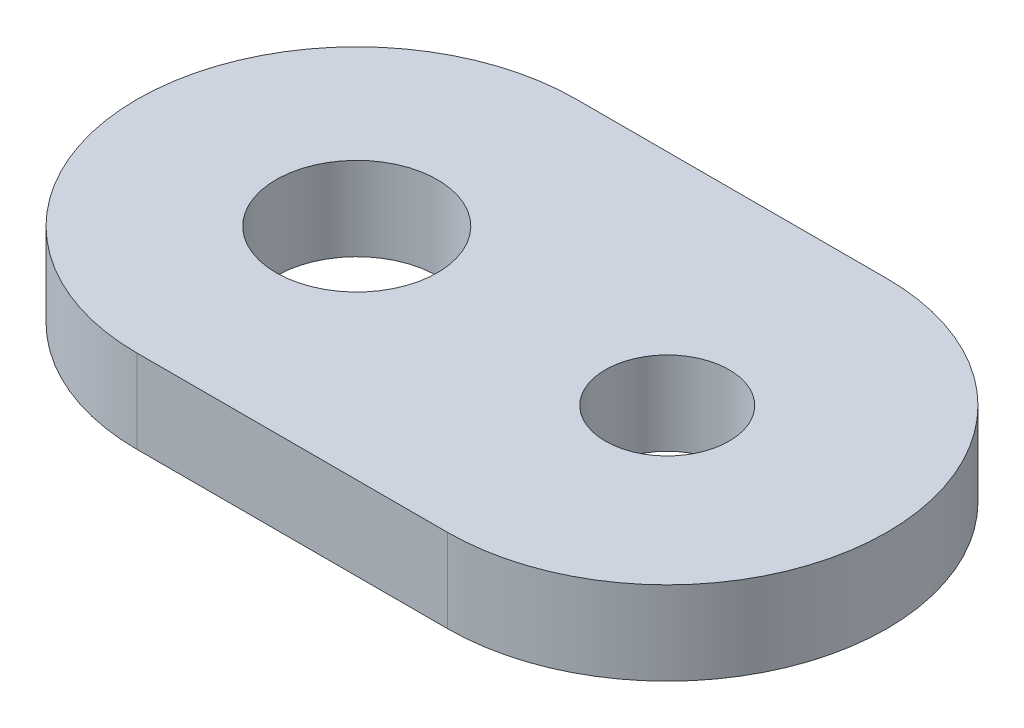
ISO-10303-21;
HEADER;
FILE_DESCRIPTION(('STEP AP214'),'2;1');
FILE_NAME('part.step','',(''),(''),'','','');
FILE_SCHEMA(('AUTOMOTIVE_DESIGN { 1 0 10303 214 1 1 1 1 }'));
ENDSEC;
DATA;
#1=APPLICATION_CONTEXT('core data for automotive mechanical design processes');
#2=APPLICATION_PROTOCOL_DEFINITION('international standard','automotive_design',2000,#1);
#3=PRODUCT_CONTEXT('',#1,'mechanical');
#4=PRODUCT('Part','Part','',(#3));
#5=PRODUCT_RELATED_PRODUCT_CATEGORY('part','',(#4));
#6=PRODUCT_DEFINITION_FORMATION('','',#4);
#7=PRODUCT_DEFINITION_CONTEXT('part definition',#1,'design');
#8=PRODUCT_DEFINITION('design','',#6,#7);
#9=PRODUCT_DEFINITION_SHAPE('','',#8);
#10=(LENGTH_UNIT() NAMED_UNIT(*) SI_UNIT(.MILLI.,.METRE.));
#11=(NAMED_UNIT(*) PLANE_ANGLE_UNIT() SI_UNIT($,.RADIAN.));
#12=(NAMED_UNIT(*) SI_UNIT($,.STERADIAN.) SOLID_ANGLE_UNIT());
#13=UNCERTAINTY_MEASURE_WITH_UNIT(LENGTH_MEASURE(1.E-05),#10,'distance_accuracy_value','');
#14=(GEOMETRIC_REPRESENTATION_CONTEXT(3) GLOBAL_UNCERTAINTY_ASSIGNED_CONTEXT((#13)) GLOBAL_UNIT_ASSIGNED_CONTEXT((#10,
#11,#12)) REPRESENTATION_CONTEXT('',''));
#15=CARTESIAN_POINT('',(0.,0.,0.));
#16=DIRECTION('',(0.,0.,1.));
#17=DIRECTION('',(1.,0.,0.));
#18=AXIS2_PLACEMENT_3D('',#15,#16,#17);
#19=CARTESIAN_POINT('',(5.581105,0.,0.));
#20=DIRECTION('',(0.,-1.,0.));
#21=DIRECTION('',(0.,0.,-1.));
#22=AXIS2_PLACEMENT_3D('',#19,#20,#21);
#23=CYLINDRICAL_SURFACE('',#22,7.9);
#24=CARTESIAN_POINT('',(5.581105,-3.,0.));
#25=DIRECTION('',(0.,-1.,0.));
#26=DIRECTION('',(0.,0.,-1.));
#27=AXIS2_PLACEMENT_3D('',#24,#25,#26);
#28=CIRCLE('',#27,7.9);
#29=CARTESIAN_POINT('',(5.581105,-3.,-7.9));
#30=VERTEX_POINT('',#29);
#31=CARTESIAN_POINT('',(5.581105,-3.,7.9));
#32=VERTEX_POINT('',#31);
#33=EDGE_CURVE('E101',#30,#32,#28,.T.);
#34=ORIENTED_EDGE('',*,*,#33,.F.);
#35=DIRECTION('',(0.,-1.,0.));
#36=VECTOR('',#35,1.);
#37=CARTESIAN_POINT('',(5.581105,0.,-7.9));
#38=LINE('',#37,#36);
#39=CARTESIAN_POINT('',(5.581105,0.,-7.9));
#40=VERTEX_POINT('',#39);
#41=EDGE_CURVE('E11',#40,#30,#38,.T.);
#42=ORIENTED_EDGE('',*,*,#41,.F.);
#43=CARTESIAN_POINT('',(5.581105,0.,0.));
#44=DIRECTION('',(0.,-1.,0.));
#45=DIRECTION('',(0.,0.,-1.));
#46=AXIS2_PLACEMENT_3D('',#43,#44,#45);
#47=CIRCLE('',#46,7.9);
#48=CARTESIAN_POINT('',(5.581105,0.,7.9));
#49=VERTEX_POINT('',#48);
#50=EDGE_CURVE('E94',#40,#49,#47,.T.);
#51=ORIENTED_EDGE('',*,*,#50,.T.);
#52=DIRECTION('',(0.,-1.,0.));
#53=VECTOR('',#52,1.);
#54=CARTESIAN_POINT('',(5.581105,0.,7.9));
#55=LINE('',#54,#53);
#56=EDGE_CURVE('E39',#49,#32,#55,.T.);
#57=ORIENTED_EDGE('',*,*,#56,.T.);
#58=EDGE_LOOP('',(#34,#42,#51,#57));
#59=FACE_BOUND('',#58,.T.);
#60=ADVANCED_FACE('F36',(#59),#23,.T.);
#61=CARTESIAN_POINT('',(-5.581105,0.,-7.9));
#62=DIRECTION('',(0.,0.,-1.));
#63=DIRECTION('',(-1.,0.,0.));
#64=AXIS2_PLACEMENT_3D('',#61,#62,#63);
#65=PLANE('',#64);
#66=DIRECTION('',(1.,0.,0.));
#67=VECTOR('',#66,1.);
#68=CARTESIAN_POINT('',(-5.581105,-3.,-7.9));
#69=LINE('',#68,#67);
#70=CARTESIAN_POINT('',(-5.581105,-3.,-7.9));
#71=VERTEX_POINT('',#70);
#72=EDGE_CURVE('E96',#71,#30,#69,.T.);
#73=ORIENTED_EDGE('',*,*,#72,.F.);
#74=DIRECTION('',(0.,-1.,0.));
#75=VECTOR('',#74,1.);
#76=CARTESIAN_POINT('',(-5.581105,0.,-7.9));
#77=LINE('',#76,#75);
#78=CARTESIAN_POINT('',(-5.581105,0.,-7.9));
#79=VERTEX_POINT('',#78);
#80=EDGE_CURVE('E45',#79,#71,#77,.T.);
#81=ORIENTED_EDGE('',*,*,#80,.F.);
#82=DIRECTION('',(1.,0.,0.));
#83=VECTOR('',#82,1.);
#84=CARTESIAN_POINT('',(-5.581105,0.,-7.9));
#85=LINE('',#84,#83);
#86=EDGE_CURVE('E91',#79,#40,#85,.T.);
#87=ORIENTED_EDGE('',*,*,#86,.T.);
#88=ORIENTED_EDGE('',*,*,#41,.T.);
#89=EDGE_LOOP('',(#73,#81,#87,#88));
#90=FACE_BOUND('',#89,.T.);
#91=ADVANCED_FACE('F112',(#90),#65,.T.);
#92=CARTESIAN_POINT('',(-5.581105,0.,0.));
#93=DIRECTION('',(0.,-1.,0.));
#94=DIRECTION('',(0.,0.,-1.));
#95=AXIS2_PLACEMENT_3D('',#92,#93,#94);
#96=CYLINDRICAL_SURFACE('',#95,7.9);
#97=CARTESIAN_POINT('',(-5.581105,-3.,0.));
#98=DIRECTION('',(0.,-1.,0.));
#99=DIRECTION('',(0.,0.,-1.));
#100=AXIS2_PLACEMENT_3D('',#97,#98,#99);
#101=CIRCLE('',#100,7.9);
#102=CARTESIAN_POINT('',(-5.581105,-3.,7.9));
#103=VERTEX_POINT('',#102);
#104=EDGE_CURVE('E86',#103,#71,#101,.T.);
#105=ORIENTED_EDGE('',*,*,#104,.F.);
#106=DIRECTION('',(0.,-1.,0.));
#107=VECTOR('',#106,1.);
#108=CARTESIAN_POINT('',(-5.581105,0.,7.9));
#109=LINE('',#108,#107);
#110=CARTESIAN_POINT('',(-5.581105,0.,7.9));
#111=VERTEX_POINT('',#110);
#112=EDGE_CURVE('E81',#111,#103,#109,.T.);
#113=ORIENTED_EDGE('',*,*,#112,.F.);
#114=CARTESIAN_POINT('',(-5.581105,0.,0.));
#115=DIRECTION('',(0.,-1.,0.));
#116=DIRECTION('',(0.,0.,-1.));
#117=AXIS2_PLACEMENT_3D('',#114,#115,#116);
#118=CIRCLE('',#117,7.9);
#119=EDGE_CURVE('E84',#111,#79,#118,.T.);
#120=ORIENTED_EDGE('',*,*,#119,.T.);
#121=ORIENTED_EDGE('',*,*,#80,.T.);
#122=EDGE_LOOP('',(#105,#113,#120,#121));
#123=FACE_BOUND('',#122,.T.);
#124=ADVANCED_FACE('F83',(#123),#96,.T.);
#125=CARTESIAN_POINT('',(5.581105,0.,7.9));
#126=DIRECTION('',(0.,0.,1.));
#127=DIRECTION('',(1.,0.,0.));
#128=AXIS2_PLACEMENT_3D('',#125,#126,#127);
#129=PLANE('',#128);
#130=DIRECTION('',(-1.,0.,0.));
#131=VECTOR('',#130,1.);
#132=CARTESIAN_POINT('',(5.581105,-3.,7.9));
#133=LINE('',#132,#131);
#134=EDGE_CURVE('E104',#32,#103,#133,.T.);
#135=ORIENTED_EDGE('',*,*,#134,.F.);
#136=ORIENTED_EDGE('',*,*,#56,.F.);
#137=DIRECTION('',(-1.,0.,0.));
#138=VECTOR('',#137,1.);
#139=CARTESIAN_POINT('',(5.581105,0.,7.9));
#140=LINE('',#139,#138);
#141=EDGE_CURVE('E90',#49,#111,#140,.T.);
#142=ORIENTED_EDGE('',*,*,#141,.T.);
#143=ORIENTED_EDGE('',*,*,#112,.T.);
#144=EDGE_LOOP('',(#135,#136,#142,#143));
#145=FACE_BOUND('',#144,.T.);
#146=ADVANCED_FACE('F93',(#145),#129,.T.);
#147=CARTESIAN_POINT('',(5.581105,0.,0.));
#148=DIRECTION('',(0.,-1.,0.));
#149=DIRECTION('',(0.,0.,-1.));
#150=AXIS2_PLACEMENT_3D('',#147,#148,#149);
#151=PLANE('',#150);
#152=CARTESIAN_POINT('',(5.581105,0.,0.));
#153=DIRECTION('',(0.,-1.,0.));
#154=DIRECTION('',(0.,0.,1.));
#155=AXIS2_PLACEMENT_3D('',#152,#153,#154);
#156=CIRCLE('',#155,2.225);
#157=CARTESIAN_POINT('',(5.581105,0.,2.225));
#158=VERTEX_POINT('',#157);
#159=EDGE_CURVE('E145',#158,#158,#156,.T.);
#160=ORIENTED_EDGE('',*,*,#159,.T.);
#161=EDGE_LOOP('',(#160));
#162=FACE_BOUND('',#161,.T.);
#163=CARTESIAN_POINT('',(-5.581105,0.,0.));
#164=DIRECTION('',(0.,-1.,0.));
#165=DIRECTION('',(0.,0.,1.));
#166=AXIS2_PLACEMENT_3D('',#163,#164,#165);
#167=CIRCLE('',#166,2.9);
#168=CARTESIAN_POINT('',(-5.581105,0.,2.9));
#169=VERTEX_POINT('',#168);
#170=EDGE_CURVE('E105',#169,#169,#167,.T.);
#171=ORIENTED_EDGE('',*,*,#170,.T.);
#172=EDGE_LOOP('',(#171));
#173=FACE_BOUND('',#172,.T.);
#174=ORIENTED_EDGE('',*,*,#50,.F.);
#175=ORIENTED_EDGE('',*,*,#86,.F.);
#176=ORIENTED_EDGE('',*,*,#119,.F.);
#177=ORIENTED_EDGE('',*,*,#141,.F.);
#178=EDGE_LOOP('',(#174,#175,#176,#177));
#179=FACE_BOUND('',#178,.T.);
#180=ADVANCED_FACE('F89',(#162,#173,#179),#151,.F.);
#181=CARTESIAN_POINT('',(5.581105,-3.,0.));
#182=DIRECTION('',(0.,-1.,0.));
#183=DIRECTION('',(0.,0.,-1.));
#184=AXIS2_PLACEMENT_3D('',#181,#182,#183);
#185=PLANE('',#184);
#186=CARTESIAN_POINT('',(5.581105,-3.,0.));
#187=DIRECTION('',(0.,-1.,0.));
#188=DIRECTION('',(0.,0.,1.));
#189=AXIS2_PLACEMENT_3D('',#186,#187,#188);
#190=CIRCLE('',#189,2.225);
#191=CARTESIAN_POINT('',(5.581105,-3.,2.225));
#192=VERTEX_POINT('',#191);
#193=EDGE_CURVE('E148',#192,#192,#190,.T.);
#194=ORIENTED_EDGE('',*,*,#193,.F.);
#195=EDGE_LOOP('',(#194));
#196=FACE_BOUND('',#195,.T.);
#197=CARTESIAN_POINT('',(-5.581105,-3.,0.));
#198=DIRECTION('',(0.,-1.,0.));
#199=DIRECTION('',(0.,0.,1.));
#200=AXIS2_PLACEMENT_3D('',#197,#198,#199);
#201=CIRCLE('',#200,2.9);
#202=CARTESIAN_POINT('',(-5.581105,-3.,2.9));
#203=VERTEX_POINT('',#202);
#204=EDGE_CURVE('E150',#203,#203,#201,.T.);
#205=ORIENTED_EDGE('',*,*,#204,.F.);
#206=EDGE_LOOP('',(#205));
#207=FACE_BOUND('',#206,.T.);
#208=ORIENTED_EDGE('',*,*,#33,.T.);
#209=ORIENTED_EDGE('',*,*,#134,.T.);
#210=ORIENTED_EDGE('',*,*,#104,.T.);
#211=ORIENTED_EDGE('',*,*,#72,.T.);
#212=EDGE_LOOP('',(#208,#209,#210,#211));
#213=FACE_BOUND('',#212,.T.);
#214=ADVANCED_FACE('F111',(#196,#207,#213),#185,.T.);
#215=CARTESIAN_POINT('',(-5.581105,0.,0.));
#216=DIRECTION('',(0.,-1.,0.));
#217=DIRECTION('',(0.,0.,-1.));
#218=AXIS2_PLACEMENT_3D('',#215,#216,#217);
#219=CYLINDRICAL_SURFACE('',#218,2.9);
#220=ORIENTED_EDGE('',*,*,#170,.F.);
#221=EDGE_LOOP('',(#220));
#222=FACE_BOUND('',#221,.T.);
#223=ORIENTED_EDGE('',*,*,#204,.T.);
#224=EDGE_LOOP('',(#223));
#225=FACE_BOUND('',#224,.T.);
#226=ADVANCED_FACE('F130',(#222,#225),#219,.F.);
#227=CARTESIAN_POINT('',(5.581105,0.,0.));
#228=DIRECTION('',(0.,-1.,0.));
#229=DIRECTION('',(0.,0.,-1.));
#230=AXIS2_PLACEMENT_3D('',#227,#228,#229);
#231=CYLINDRICAL_SURFACE('',#230,2.225);
#232=ORIENTED_EDGE('',*,*,#159,.F.);
#233=EDGE_LOOP('',(#232));
#234=FACE_BOUND('',#233,.T.);
#235=ORIENTED_EDGE('',*,*,#193,.T.);
#236=EDGE_LOOP('',(#235));
#237=FACE_BOUND('',#236,.T.);
#238=ADVANCED_FACE('F137',(#234,#237),#231,.F.);
#239=CLOSED_SHELL('',(#60,#91,#124,#146,#180,#214,#226,#238));
#240=MANIFOLD_SOLID_BREP('B2',#239);
#241=ADVANCED_BREP_SHAPE_REPRESENTATION('',(#18,#240),#14);
#242=SHAPE_DEFINITION_REPRESENTATION(#9,#241);
ENDSEC;
END-ISO-10303-21;
